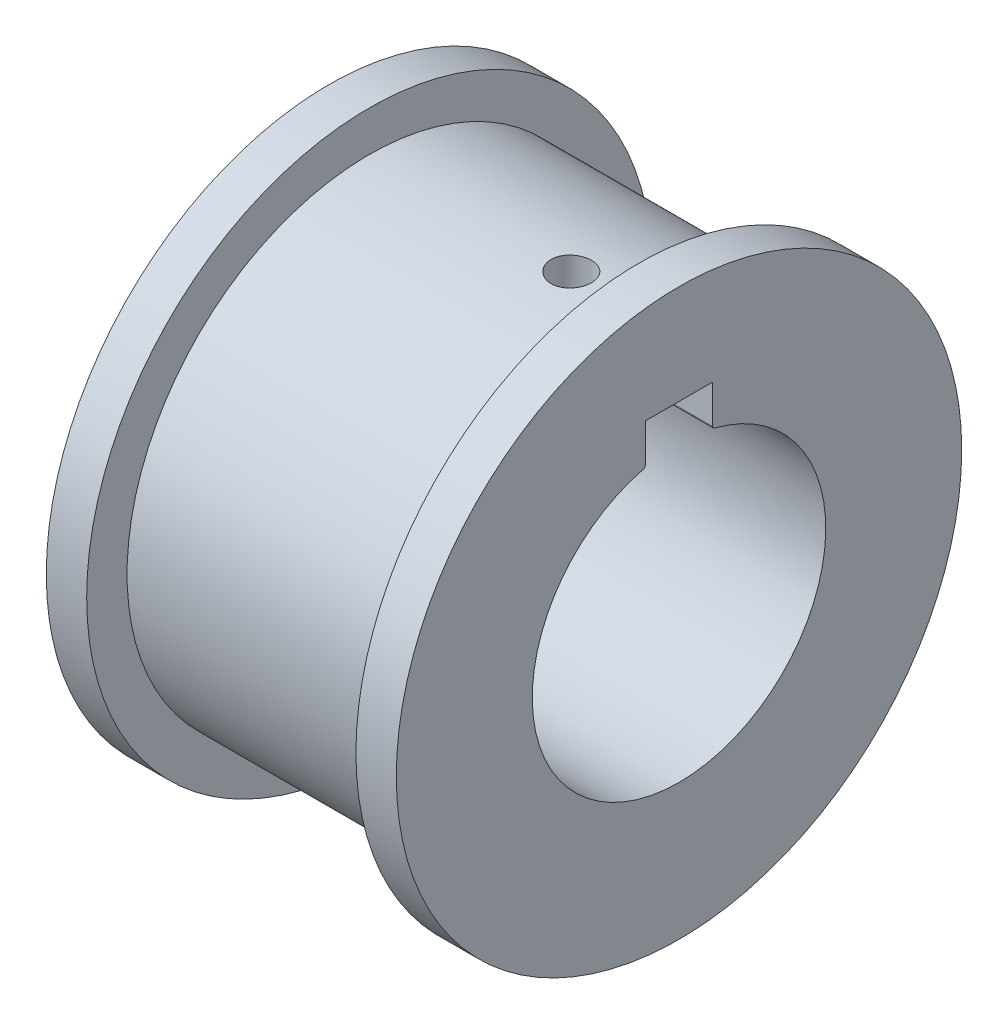
ISO-10303-21;
HEADER;
FILE_DESCRIPTION(('STEP AP214'),'2;1');
FILE_NAME('part.step','',(''),(''),'','','');
FILE_SCHEMA(('AUTOMOTIVE_DESIGN { 1 0 10303 214 1 1 1 1 }'));
ENDSEC;
DATA;
#1=APPLICATION_CONTEXT('core data for automotive mechanical design processes');
#2=APPLICATION_PROTOCOL_DEFINITION('international standard','automotive_design',2000,#1);
#3=PRODUCT_CONTEXT('',#1,'mechanical');
#4=PRODUCT('Part','Part','',(#3));
#5=PRODUCT_RELATED_PRODUCT_CATEGORY('part','',(#4));
#6=PRODUCT_DEFINITION_FORMATION('','',#4);
#7=PRODUCT_DEFINITION_CONTEXT('part definition',#1,'design');
#8=PRODUCT_DEFINITION('design','',#6,#7);
#9=PRODUCT_DEFINITION_SHAPE('','',#8);
#10=(LENGTH_UNIT() NAMED_UNIT(*) SI_UNIT(.MILLI.,.METRE.));
#11=(NAMED_UNIT(*) PLANE_ANGLE_UNIT() SI_UNIT($,.RADIAN.));
#12=(NAMED_UNIT(*) SI_UNIT($,.STERADIAN.) SOLID_ANGLE_UNIT());
#13=UNCERTAINTY_MEASURE_WITH_UNIT(LENGTH_MEASURE(1.E-05),#10,'distance_accuracy_value','');
#14=(GEOMETRIC_REPRESENTATION_CONTEXT(3) GLOBAL_UNCERTAINTY_ASSIGNED_CONTEXT((#13)) GLOBAL_UNIT_ASSIGNED_CONTEXT((#10,
#11,#12)) REPRESENTATION_CONTEXT('',''));
#15=CARTESIAN_POINT('',(0.,0.,0.));
#16=DIRECTION('',(0.,0.,1.));
#17=DIRECTION('',(1.,0.,0.));
#18=AXIS2_PLACEMENT_3D('',#15,#16,#17);
#19=CARTESIAN_POINT('',(23.,0.,0.));
#20=DIRECTION('',(1.,0.,0.));
#21=DIRECTION('',(0.,0.,-1.));
#22=AXIS2_PLACEMENT_3D('',#19,#20,#21);
#23=PLANE('',#22);
#24=CARTESIAN_POINT('',(23.,0.,0.));
#25=DIRECTION('',(1.,0.,0.));
#26=DIRECTION('',(0.,0.,-1.));
#27=AXIS2_PLACEMENT_3D('',#24,#25,#26);
#28=CIRCLE('',#27,21.);
#29=CARTESIAN_POINT('',(23.,0.,-21.));
#30=VERTEX_POINT('',#29);
#31=EDGE_CURVE('E131',#30,#30,#28,.T.);
#32=ORIENTED_EDGE('',*,*,#31,.T.);
#33=EDGE_LOOP('',(#32));
#34=FACE_BOUND('',#33,.T.);
#35=CARTESIAN_POINT('',(23.,0.,0.));
#36=DIRECTION('',(1.,0.,0.));
#37=DIRECTION('',(0.,0.,-1.));
#38=AXIS2_PLACEMENT_3D('',#35,#36,#37);
#39=CIRCLE('',#38,10.9);
#40=CARTESIAN_POINT('',(23.,10.5726220026863,2.65135135135135));
#41=VERTEX_POINT('',#40);
#42=CARTESIAN_POINT('',(23.,10.5726220026863,-2.65135135135136));
#43=VERTEX_POINT('',#42);
#44=EDGE_CURVE('E92',#41,#43,#39,.T.);
#45=ORIENTED_EDGE('',*,*,#44,.F.);
#46=CARTESIAN_POINT('',(23.,10.7666150669558,2.7));
#47=DIRECTION('',(-1.,0.,0.));
#48=DIRECTION('',(0.,0.,-1.));
#49=AXIS2_PLACEMENT_3D('',#46,#47,#48);
#50=CIRCLE('',#49,0.200000000000001);
#51=CARTESIAN_POINT('',(23.,10.7666150669558,2.5));
#52=VERTEX_POINT('',#51);
#53=EDGE_CURVE('E85',#52,#41,#50,.T.);
#54=ORIENTED_EDGE('',*,*,#53,.F.);
#55=DIRECTION('',(0.,-1.,0.));
#56=VECTOR('',#55,1.);
#57=CARTESIAN_POINT('',(23.,13.6094297678999,2.5));
#58=LINE('',#57,#56);
#59=CARTESIAN_POINT('',(23.,13.6094297678999,2.5));
#60=VERTEX_POINT('',#59);
#61=EDGE_CURVE('E114',#60,#52,#58,.T.);
#62=ORIENTED_EDGE('',*,*,#61,.F.);
#63=DIRECTION('',(0.,0.,1.));
#64=VECTOR('',#63,1.);
#65=CARTESIAN_POINT('',(23.,13.6094297678999,2.5));
#66=LINE('',#65,#64);
#67=CARTESIAN_POINT('',(23.,13.6094297678999,-2.5));
#68=VERTEX_POINT('',#67);
#69=EDGE_CURVE('E112',#68,#60,#66,.T.);
#70=ORIENTED_EDGE('',*,*,#69,.F.);
#71=DIRECTION('',(0.,1.,0.));
#72=VECTOR('',#71,1.);
#73=CARTESIAN_POINT('',(23.,13.6094297678999,-2.5));
#74=LINE('',#73,#72);
#75=CARTESIAN_POINT('',(23.,10.7666150669558,-2.5));
#76=VERTEX_POINT('',#75);
#77=EDGE_CURVE('E107',#76,#68,#74,.T.);
#78=ORIENTED_EDGE('',*,*,#77,.F.);
#79=CARTESIAN_POINT('',(23.,10.7666150669558,-2.7));
#80=DIRECTION('',(-1.,0.,0.));
#81=DIRECTION('',(0.,0.,1.));
#82=AXIS2_PLACEMENT_3D('',#79,#80,#81);
#83=CIRCLE('',#82,0.2);
#84=EDGE_CURVE('E105',#43,#76,#83,.T.);
#85=ORIENTED_EDGE('',*,*,#84,.F.);
#86=EDGE_LOOP('',(#45,#54,#62,#70,#78,#85));
#87=FACE_BOUND('',#86,.T.);
#88=ADVANCED_FACE('F32',(#34,#87),#23,.T.);
#89=CARTESIAN_POINT('',(-3.,0.,0.));
#90=DIRECTION('',(-1.,0.,0.));
#91=DIRECTION('',(0.,0.,1.));
#92=AXIS2_PLACEMENT_3D('',#89,#90,#91);
#93=PLANE('',#92);
#94=CARTESIAN_POINT('',(-3.,0.,0.));
#95=DIRECTION('',(-1.,0.,0.));
#96=DIRECTION('',(0.,0.,1.));
#97=AXIS2_PLACEMENT_3D('',#94,#95,#96);
#98=CIRCLE('',#97,21.);
#99=CARTESIAN_POINT('',(-3.,0.,21.));
#100=VERTEX_POINT('',#99);
#101=EDGE_CURVE('E125',#100,#100,#98,.T.);
#102=ORIENTED_EDGE('',*,*,#101,.T.);
#103=EDGE_LOOP('',(#102));
#104=FACE_BOUND('',#103,.T.);
#105=DIRECTION('',(0.,-1.,0.));
#106=VECTOR('',#105,1.);
#107=CARTESIAN_POINT('',(-3.,0.,2.5));
#108=LINE('',#107,#106);
#109=CARTESIAN_POINT('',(-3.,13.6094297678999,2.5));
#110=VERTEX_POINT('',#109);
#111=CARTESIAN_POINT('',(-3.,10.7666150669558,2.5));
#112=VERTEX_POINT('',#111);
#113=EDGE_CURVE('E140',#110,#112,#108,.T.);
#114=ORIENTED_EDGE('',*,*,#113,.T.);
#115=CARTESIAN_POINT('',(-3.,10.7666150669558,2.7));
#116=DIRECTION('',(-1.,0.,0.));
#117=DIRECTION('',(0.,0.,1.));
#118=AXIS2_PLACEMENT_3D('',#115,#116,#117);
#119=CIRCLE('',#118,0.200000000000001);
#120=CARTESIAN_POINT('',(-3.,10.5726220026863,2.65135135135135));
#121=VERTEX_POINT('',#120);
#122=EDGE_CURVE('E11',#112,#121,#119,.T.);
#123=ORIENTED_EDGE('',*,*,#122,.T.);
#124=CARTESIAN_POINT('',(-3.,0.,0.));
#125=DIRECTION('',(-1.,0.,0.));
#126=DIRECTION('',(0.,0.,1.));
#127=AXIS2_PLACEMENT_3D('',#124,#125,#126);
#128=CIRCLE('',#127,10.9);
#129=CARTESIAN_POINT('',(-3.,10.5726220026863,-2.65135135135136));
#130=VERTEX_POINT('',#129);
#131=EDGE_CURVE('E41',#121,#130,#128,.F.);
#132=ORIENTED_EDGE('',*,*,#131,.T.);
#133=CARTESIAN_POINT('',(-3.,10.7666150669558,-2.7));
#134=DIRECTION('',(-1.,0.,0.));
#135=DIRECTION('',(0.,0.,1.));
#136=AXIS2_PLACEMENT_3D('',#133,#134,#135);
#137=CIRCLE('',#136,0.2);
#138=CARTESIAN_POINT('',(-3.,10.7666150669558,-2.5));
#139=VERTEX_POINT('',#138);
#140=EDGE_CURVE('E151',#130,#139,#137,.T.);
#141=ORIENTED_EDGE('',*,*,#140,.T.);
#142=DIRECTION('',(0.,1.,0.));
#143=VECTOR('',#142,1.);
#144=CARTESIAN_POINT('',(-3.,0.,-2.50000000000001));
#145=LINE('',#144,#143);
#146=CARTESIAN_POINT('',(-3.,13.6094297678999,-2.5));
#147=VERTEX_POINT('',#146);
#148=EDGE_CURVE('E148',#139,#147,#145,.T.);
#149=ORIENTED_EDGE('',*,*,#148,.T.);
#150=DIRECTION('',(0.,0.,1.));
#151=VECTOR('',#150,1.);
#152=CARTESIAN_POINT('',(-3.,13.6094297678999,0.));
#153=LINE('',#152,#151);
#154=EDGE_CURVE('E145',#147,#110,#153,.T.);
#155=ORIENTED_EDGE('',*,*,#154,.T.);
#156=EDGE_LOOP('',(#114,#123,#132,#141,#149,#155));
#157=FACE_BOUND('',#156,.T.);
#158=ADVANCED_FACE('F154',(#104,#157),#93,.T.);
#159=CARTESIAN_POINT('',(20.,0.,0.));
#160=DIRECTION('',(-1.,0.,0.));
#161=DIRECTION('',(0.,0.,1.));
#162=AXIS2_PLACEMENT_3D('',#159,#160,#161);
#163=CYLINDRICAL_SURFACE('',#162,18.);
#164=CARTESIAN_POINT('',(15.,17.9373911146521,-1.5));
#165=CARTESIAN_POINT('',(15.0840985631856,17.9373919441254,-1.49999632624557));
#166=CARTESIAN_POINT('',(15.1682543792365,17.9379889197393,-1.49290363793974));
#167=CARTESIAN_POINT('',(15.3342375305151,17.940312296239,-1.46471396861144));
#168=CARTESIAN_POINT('',(15.4160621176914,17.942039976827,-1.44360111954249));
#169=CARTESIAN_POINT('',(15.574954794188,17.9464277324401,-1.38798597710629));
#170=CARTESIAN_POINT('',(15.6520255514324,17.949087278784,-1.35349127456329));
#171=CARTESIAN_POINT('',(15.7992647928149,17.9550384405243,-1.27210510272819));
#172=CARTESIAN_POINT('',(15.8694347481826,17.9583299207505,-1.22521628371904));
#173=CARTESIAN_POINT('',(16.0010790046,17.9651835716923,-1.12024280468706));
#174=CARTESIAN_POINT('',(16.0625331477945,17.9687463415354,-1.06213290210282));
#175=CARTESIAN_POINT('',(16.174828149357,17.9757356491616,-0.936420181014144));
#176=CARTESIAN_POINT('',(16.2256685440314,17.9791621809873,-0.86881694798052));
#177=CARTESIAN_POINT('',(16.3153599219843,17.9854986076127,-0.725916367963188));
#178=CARTESIAN_POINT('',(16.3541934647722,17.9884077482992,-0.650608038188791));
#179=CARTESIAN_POINT('',(16.4186572366777,17.9933751565843,-0.494511600748147));
#180=CARTESIAN_POINT('',(16.4442876968973,17.995433439076,-0.413723589024245));
#181=CARTESIAN_POINT('',(16.4815597257841,17.99846303179,-0.249161693921719));
#182=CARTESIAN_POINT('',(16.4932339066792,17.9994368756993,-0.165395244348485));
#183=CARTESIAN_POINT('',(16.5023628047769,18.0001964510134,0.00291342283472642));
#184=CARTESIAN_POINT('',(16.4998177864049,17.9999822045124,0.0874556259893205));
#185=CARTESIAN_POINT('',(16.4806072017309,17.9983918295819,0.25469482727822));
#186=CARTESIAN_POINT('',(16.4639767052937,17.9970185868379,0.337395885108696));
#187=CARTESIAN_POINT('',(16.4171217735569,17.9932679978193,0.498828699060365));
#188=CARTESIAN_POINT('',(16.3868972089162,17.9908906419909,0.577560417407251));
#189=CARTESIAN_POINT('',(16.3136730193221,17.9853943186844,0.728931240955282));
#190=CARTESIAN_POINT('',(16.2706576881019,17.9822744403804,0.801562713988459));
#191=CARTESIAN_POINT('',(16.1730844176321,17.9756436790388,0.938588003816052));
#192=CARTESIAN_POINT('',(16.1185262442516,17.9721327880706,1.0029816534748));
#193=CARTESIAN_POINT('',(15.9992183400671,17.965101971209,1.12190844717284));
#194=CARTESIAN_POINT('',(15.9344381357718,17.96158205029,1.17641102499754));
#195=CARTESIAN_POINT('',(15.7966312423255,17.9549406265857,1.27377239838405));
#196=CARTESIAN_POINT('',(15.7236045463767,17.9518191241289,1.31663118434747));
#197=CARTESIAN_POINT('',(15.5713561683423,17.9463273914548,1.38948720688987));
#198=CARTESIAN_POINT('',(15.4921337235797,17.9439572539101,1.41948285710205));
#199=CARTESIAN_POINT('',(15.3297529229235,17.9402383991997,1.46573851054276));
#200=CARTESIAN_POINT('',(15.2465946498153,17.9388896605602,1.4819988025422));
#201=CARTESIAN_POINT('',(15.0789702201671,17.937369793448,1.50028347436892));
#202=CARTESIAN_POINT('',(14.9945087438297,17.9371951390236,1.50235047917683));
#203=CARTESIAN_POINT('',(14.8264404845256,17.9380339082073,1.49230155756723));
#204=CARTESIAN_POINT('',(14.7428336935942,17.9390473207338,1.48018576343823));
#205=CARTESIAN_POINT('',(14.5789704663007,17.9421448221712,1.44215070186372));
#206=CARTESIAN_POINT('',(14.4987093810554,17.9442273679871,1.41625132648417));
#207=CARTESIAN_POINT('',(14.3436718767544,17.9492272046942,1.35140451334476));
#208=CARTESIAN_POINT('',(14.2688955457271,17.9521445089794,1.3124568662206));
#209=CARTESIAN_POINT('',(14.1267551216711,17.9584937019478,1.22251123196842));
#210=CARTESIAN_POINT('',(14.0594090574024,17.9619267965011,1.17148484052755));
#211=CARTESIAN_POINT('',(13.9342230886397,17.9689166666067,1.05887119262326));
#212=CARTESIAN_POINT('',(13.8763833477565,17.9724734442863,0.997283754433896));
#213=CARTESIAN_POINT('',(13.7717063913449,17.9793204166324,0.86511205936761));
#214=CARTESIAN_POINT('',(13.7248968704953,17.9826099269711,0.79450582861474));
#215=CARTESIAN_POINT('',(13.6437991296532,17.9885418580659,0.646410289821602));
#216=CARTESIAN_POINT('',(13.6095107845369,17.9911842852881,0.56892105057266));
#217=CARTESIAN_POINT('',(13.5544762763759,17.9955211682902,0.409358368150552));
#218=CARTESIAN_POINT('',(13.5337129872812,17.9972168225275,0.327290865780904));
#219=CARTESIAN_POINT('',(13.5062620113689,17.9994739699475,0.160819768599443));
#220=CARTESIAN_POINT('',(13.4995740581226,18.0000354845981,0.076416218036738));
#221=CARTESIAN_POINT('',(13.5004667094015,17.9999611181007,-0.0920580725938577));
#222=CARTESIAN_POINT('',(13.5080041527578,17.9993288589703,-0.176129046317084));
#223=CARTESIAN_POINT('',(13.5370436317673,17.9969451509331,-0.341806668092005));
#224=CARTESIAN_POINT('',(13.5585456863876,17.9951937005063,-0.423413312796426));
#225=CARTESIAN_POINT('',(13.6148930551836,17.990768125559,-0.581848569673132));
#226=CARTESIAN_POINT('',(13.6497375940244,17.9880940546532,-0.658677459180395));
#227=CARTESIAN_POINT('',(13.7317758680965,17.9821223994119,-0.805401859348538));
#228=CARTESIAN_POINT('',(13.7789694080388,17.9788248249368,-0.875297479629091));
#229=CARTESIAN_POINT('',(13.8845280222736,17.9719643775245,-1.00639213413819));
#230=CARTESIAN_POINT('',(13.9429250330198,17.9684007644022,-1.06756541397693));
#231=CARTESIAN_POINT('',(14.0691752530889,17.9614161747032,-1.17926673983932));
#232=CARTESIAN_POINT('',(14.1370307491243,17.9579952328797,-1.22979220417235));
#233=CARTESIAN_POINT('',(14.2804035010514,17.9516763661302,-1.31883206846829));
#234=CARTESIAN_POINT('',(14.3559348750019,17.9487794332231,-1.3573237851877));
#235=CARTESIAN_POINT('',(14.5123611551019,17.9438486940789,-1.4210293514007));
#236=CARTESIAN_POINT('',(14.5932497736258,17.9418138960345,-1.4462584663942));
#237=CARTESIAN_POINT('',(14.7288463263408,17.939361122821,-1.47629714700913));
#238=CARTESIAN_POINT('',(14.7826821791678,17.9386257658358,-1.48517390108766));
#239=CARTESIAN_POINT('',(14.8910040047623,17.9376404935845,-1.49702651025999));
#240=CARTESIAN_POINT('',(14.9454899757822,17.9373905770138,-1.50000238121123));
#241=CARTESIAN_POINT('',(15.,17.9373911146521,-1.5));
#242=B_SPLINE_CURVE_WITH_KNOTS('',3,(#164,#165,#166,#167,#168,#169,#170,#171,#172,#173,#174,
#175,#176,#177,#178,#179,#180,#181,#182,#183,#184,#185,#186,#187,#188,#189,#190,#191,#192,#193,
#194,#195,#196,#197,#198,#199,#200,#201,#202,#203,#204,#205,#206,#207,#208,#209,#210,#211,#212,
#213,#214,#215,#216,#217,#218,#219,#220,#221,#222,#223,#224,#225,#226,#227,#228,#229,#230,#231,
#232,#233,#234,#235,#236,#237,#238,#239,#240,#241),.UNSPECIFIED.,.T.,.F.,(4,2,2,2,2,2,2,2,2,2,2,
2,2,2,2,2,2,2,2,2,2,2,2,2,2,2,2,2,2,2,2,2,2,2,2,2,2,2,4),(0.,0.252096663075892,0.50447913707576,
0.756718656565788,1.00890428225374,1.26166396783762,1.51443469368451,1.76757087390708,
2.02070262317667,2.27324170533034,2.52577609119157,2.77768356187025,3.02959342937963,
3.28181391301508,3.53403951309371,3.78703176034209,4.0400242161406,4.29304786367221,
4.54606619152565,4.79832432644861,5.05058010848022,5.3024728255471,5.55436958451818,
5.80686469264508,6.05936414593926,6.31249097605477,6.56561527661194,6.81841843321506,
7.07121680452791,7.32324939506092,7.575282327912,7.82730061729244,8.07931492145807,
8.33205858485541,8.58486345866072,8.83814202808076,9.09112842731077,9.254529936414,
9.41793100640811),.UNSPECIFIED.);
#243=CARTESIAN_POINT('',(15.,17.9373911146521,-1.5));
#244=VERTEX_POINT('',#243);
#245=EDGE_CURVE('E93',#244,#244,#242,.T.);
#246=ORIENTED_EDGE('',*,*,#245,.T.);
#247=EDGE_LOOP('',(#246));
#248=FACE_BOUND('',#247,.T.);
#249=CARTESIAN_POINT('',(20.,0.,0.));
#250=DIRECTION('',(1.,0.,0.));
#251=DIRECTION('',(0.,0.,-1.));
#252=AXIS2_PLACEMENT_3D('',#249,#250,#251);
#253=CIRCLE('',#252,18.);
#254=CARTESIAN_POINT('',(20.,0.,-18.));
#255=VERTEX_POINT('',#254);
#256=EDGE_CURVE('E134',#255,#255,#253,.T.);
#257=ORIENTED_EDGE('',*,*,#256,.F.);
#258=EDGE_LOOP('',(#257));
#259=FACE_BOUND('',#258,.T.);
#260=CARTESIAN_POINT('',(0.,0.,0.));
#261=DIRECTION('',(1.,0.,0.));
#262=DIRECTION('',(0.,0.,-1.));
#263=AXIS2_PLACEMENT_3D('',#260,#261,#262);
#264=CIRCLE('',#263,18.);
#265=CARTESIAN_POINT('',(0.,0.,-18.));
#266=VERTEX_POINT('',#265);
#267=EDGE_CURVE('E128',#266,#266,#264,.T.);
#268=ORIENTED_EDGE('',*,*,#267,.T.);
#269=EDGE_LOOP('',(#268));
#270=FACE_BOUND('',#269,.T.);
#271=ADVANCED_FACE('F34',(#248,#259,#270),#163,.T.);
#272=CARTESIAN_POINT('',(23.,0.,0.));
#273=DIRECTION('',(-1.,0.,0.));
#274=DIRECTION('',(0.,0.,1.));
#275=AXIS2_PLACEMENT_3D('',#272,#273,#274);
#276=CYLINDRICAL_SURFACE('',#275,21.);
#277=ORIENTED_EDGE('',*,*,#31,.F.);
#278=EDGE_LOOP('',(#277));
#279=FACE_BOUND('',#278,.T.);
#280=CARTESIAN_POINT('',(20.,0.,0.));
#281=DIRECTION('',(1.,0.,0.));
#282=DIRECTION('',(0.,0.,-1.));
#283=AXIS2_PLACEMENT_3D('',#280,#281,#282);
#284=CIRCLE('',#283,21.);
#285=CARTESIAN_POINT('',(20.,0.,-21.));
#286=VERTEX_POINT('',#285);
#287=EDGE_CURVE('E135',#286,#286,#284,.T.);
#288=ORIENTED_EDGE('',*,*,#287,.T.);
#289=EDGE_LOOP('',(#288));
#290=FACE_BOUND('',#289,.T.);
#291=ADVANCED_FACE('F187',(#279,#290),#276,.T.);
#292=CARTESIAN_POINT('',(20.,0.,0.));
#293=DIRECTION('',(1.,0.,0.));
#294=DIRECTION('',(0.,0.,-1.));
#295=AXIS2_PLACEMENT_3D('',#292,#293,#294);
#296=PLANE('',#295);
#297=ORIENTED_EDGE('',*,*,#256,.T.);
#298=EDGE_LOOP('',(#297));
#299=FACE_BOUND('',#298,.T.);
#300=ORIENTED_EDGE('',*,*,#287,.F.);
#301=EDGE_LOOP('',(#300));
#302=FACE_BOUND('',#301,.T.);
#303=ADVANCED_FACE('F185',(#299,#302),#296,.F.);
#304=CARTESIAN_POINT('',(-3.,0.,0.));
#305=DIRECTION('',(1.,0.,0.));
#306=DIRECTION('',(0.,0.,-1.));
#307=AXIS2_PLACEMENT_3D('',#304,#305,#306);
#308=CYLINDRICAL_SURFACE('',#307,21.);
#309=ORIENTED_EDGE('',*,*,#101,.F.);
#310=EDGE_LOOP('',(#309));
#311=FACE_BOUND('',#310,.T.);
#312=CARTESIAN_POINT('',(0.,0.,0.));
#313=DIRECTION('',(-1.,0.,0.));
#314=DIRECTION('',(0.,0.,1.));
#315=AXIS2_PLACEMENT_3D('',#312,#313,#314);
#316=CIRCLE('',#315,21.);
#317=CARTESIAN_POINT('',(0.,0.,21.));
#318=VERTEX_POINT('',#317);
#319=EDGE_CURVE('E100',#318,#318,#316,.T.);
#320=ORIENTED_EDGE('',*,*,#319,.T.);
#321=EDGE_LOOP('',(#320));
#322=FACE_BOUND('',#321,.T.);
#323=ADVANCED_FACE('F183',(#311,#322),#308,.T.);
#324=CARTESIAN_POINT('',(0.,0.,0.));
#325=DIRECTION('',(-1.,0.,0.));
#326=DIRECTION('',(0.,0.,1.));
#327=AXIS2_PLACEMENT_3D('',#324,#325,#326);
#328=PLANE('',#327);
#329=ORIENTED_EDGE('',*,*,#267,.F.);
#330=EDGE_LOOP('',(#329));
#331=FACE_BOUND('',#330,.T.);
#332=ORIENTED_EDGE('',*,*,#319,.F.);
#333=EDGE_LOOP('',(#332));
#334=FACE_BOUND('',#333,.T.);
#335=ADVANCED_FACE('F208',(#331,#334),#328,.F.);
#336=CARTESIAN_POINT('',(23.,10.7666150669558,2.7));
#337=DIRECTION('',(-1.,0.,0.));
#338=DIRECTION('',(0.,0.,1.));
#339=AXIS2_PLACEMENT_3D('',#336,#337,#338);
#340=CYLINDRICAL_SURFACE('',#339,0.200000000000001);
#341=DIRECTION('',(-1.,0.,0.));
#342=VECTOR('',#341,1.);
#343=CARTESIAN_POINT('',(23.,10.7666150669558,2.5));
#344=LINE('',#343,#342);
#345=EDGE_CURVE('E53',#52,#112,#344,.T.);
#346=ORIENTED_EDGE('',*,*,#345,.F.);
#347=ORIENTED_EDGE('',*,*,#53,.T.);
#348=DIRECTION('',(-1.,0.,0.));
#349=VECTOR('',#348,1.);
#350=CARTESIAN_POINT('',(23.,10.5726220026863,2.65135135135135));
#351=LINE('',#350,#349);
#352=EDGE_CURVE('E88',#41,#121,#351,.T.);
#353=ORIENTED_EDGE('',*,*,#352,.T.);
#354=ORIENTED_EDGE('',*,*,#122,.F.);
#355=EDGE_LOOP('',(#346,#347,#353,#354));
#356=FACE_BOUND('',#355,.T.);
#357=ADVANCED_FACE('F87',(#356),#340,.T.);
#358=CARTESIAN_POINT('',(23.,0.,0.));
#359=DIRECTION('',(-1.,0.,0.));
#360=DIRECTION('',(0.,0.,1.));
#361=AXIS2_PLACEMENT_3D('',#358,#359,#360);
#362=CYLINDRICAL_SURFACE('',#361,10.9);
#363=ORIENTED_EDGE('',*,*,#352,.F.);
#364=ORIENTED_EDGE('',*,*,#44,.T.);
#365=DIRECTION('',(-1.,0.,0.));
#366=VECTOR('',#365,1.);
#367=CARTESIAN_POINT('',(23.,10.5726220026863,-2.65135135135136));
#368=LINE('',#367,#366);
#369=EDGE_CURVE('E101',#43,#130,#368,.T.);
#370=ORIENTED_EDGE('',*,*,#369,.T.);
#371=ORIENTED_EDGE('',*,*,#131,.F.);
#372=EDGE_LOOP('',(#363,#364,#370,#371));
#373=FACE_BOUND('',#372,.T.);
#374=ADVANCED_FACE('F96',(#373),#362,.F.);
#375=CARTESIAN_POINT('',(23.,10.7666150669558,-2.7));
#376=DIRECTION('',(-1.,0.,0.));
#377=DIRECTION('',(0.,0.,1.));
#378=AXIS2_PLACEMENT_3D('',#375,#376,#377);
#379=CYLINDRICAL_SURFACE('',#378,0.2);
#380=ORIENTED_EDGE('',*,*,#369,.F.);
#381=ORIENTED_EDGE('',*,*,#84,.T.);
#382=DIRECTION('',(-1.,0.,0.));
#383=VECTOR('',#382,1.);
#384=CARTESIAN_POINT('',(23.,10.7666150669558,-2.5));
#385=LINE('',#384,#383);
#386=EDGE_CURVE('E121',#76,#139,#385,.T.);
#387=ORIENTED_EDGE('',*,*,#386,.T.);
#388=ORIENTED_EDGE('',*,*,#140,.F.);
#389=EDGE_LOOP('',(#380,#381,#387,#388));
#390=FACE_BOUND('',#389,.T.);
#391=ADVANCED_FACE('F164',(#390),#379,.T.);
#392=CARTESIAN_POINT('',(23.,13.6094297678999,-2.5));
#393=DIRECTION('',(0.,0.,1.));
#394=DIRECTION('',(0.,-1.,0.));
#395=AXIS2_PLACEMENT_3D('',#392,#393,#394);
#396=PLANE('',#395);
#397=ORIENTED_EDGE('',*,*,#386,.F.);
#398=ORIENTED_EDGE('',*,*,#77,.T.);
#399=DIRECTION('',(-1.,0.,0.));
#400=VECTOR('',#399,1.);
#401=CARTESIAN_POINT('',(23.,13.6094297678999,-2.5));
#402=LINE('',#401,#400);
#403=EDGE_CURVE('E118',#68,#147,#402,.T.);
#404=ORIENTED_EDGE('',*,*,#403,.T.);
#405=ORIENTED_EDGE('',*,*,#148,.F.);
#406=EDGE_LOOP('',(#397,#398,#404,#405));
#407=FACE_BOUND('',#406,.T.);
#408=ADVANCED_FACE('F162',(#407),#396,.T.);
#409=CARTESIAN_POINT('',(23.,13.6094297678999,2.5));
#410=DIRECTION('',(0.,-1.,0.));
#411=DIRECTION('',(0.,0.,-1.));
#412=AXIS2_PLACEMENT_3D('',#409,#410,#411);
#413=PLANE('',#412);
#414=CARTESIAN_POINT('',(15.,13.6094297678999,0.));
#415=DIRECTION('',(0.,-1.,0.));
#416=DIRECTION('',(0.,0.,-1.));
#417=AXIS2_PLACEMENT_3D('',#414,#415,#416);
#418=CIRCLE('',#417,1.5);
#419=CARTESIAN_POINT('',(15.,13.6094297678999,-1.50000000000001));
#420=VERTEX_POINT('',#419);
#421=EDGE_CURVE('E288',#420,#420,#418,.T.);
#422=ORIENTED_EDGE('',*,*,#421,.F.);
#423=EDGE_LOOP('',(#422));
#424=FACE_BOUND('',#423,.T.);
#425=ORIENTED_EDGE('',*,*,#403,.F.);
#426=ORIENTED_EDGE('',*,*,#69,.T.);
#427=DIRECTION('',(-1.,0.,0.));
#428=VECTOR('',#427,1.);
#429=CARTESIAN_POINT('',(23.,13.6094297678999,2.5));
#430=LINE('',#429,#428);
#431=EDGE_CURVE('E48',#60,#110,#430,.T.);
#432=ORIENTED_EDGE('',*,*,#431,.T.);
#433=ORIENTED_EDGE('',*,*,#154,.F.);
#434=EDGE_LOOP('',(#425,#426,#432,#433));
#435=FACE_BOUND('',#434,.T.);
#436=ADVANCED_FACE('F158',(#424,#435),#413,.T.);
#437=CARTESIAN_POINT('',(23.,13.6094297678999,2.5));
#438=DIRECTION('',(0.,0.,-1.));
#439=DIRECTION('',(-1.,0.,0.));
#440=AXIS2_PLACEMENT_3D('',#437,#438,#439);
#441=PLANE('',#440);
#442=ORIENTED_EDGE('',*,*,#431,.F.);
#443=ORIENTED_EDGE('',*,*,#61,.T.);
#444=ORIENTED_EDGE('',*,*,#345,.T.);
#445=ORIENTED_EDGE('',*,*,#113,.F.);
#446=EDGE_LOOP('',(#442,#443,#444,#445));
#447=FACE_BOUND('',#446,.T.);
#448=ADVANCED_FACE('F155',(#447),#441,.T.);
#449=CARTESIAN_POINT('',(15.,33.6094297678999,0.));
#450=DIRECTION('',(0.,-1.,0.));
#451=DIRECTION('',(0.,0.,-1.));
#452=AXIS2_PLACEMENT_3D('',#449,#450,#451);
#453=CYLINDRICAL_SURFACE('',#452,1.5);
#454=ORIENTED_EDGE('',*,*,#421,.T.);
#455=EDGE_LOOP('',(#454));
#456=FACE_BOUND('',#455,.T.);
#457=ORIENTED_EDGE('',*,*,#245,.F.);
#458=EDGE_LOOP('',(#457));
#459=FACE_BOUND('',#458,.T.);
#460=ADVANCED_FACE('F255',(#456,#459),#453,.F.);
#461=CLOSED_SHELL('',(#88,#158,#271,#291,#303,#323,#335,#357,#374,#391,#408,#436,#448,#460));
#462=MANIFOLD_SOLID_BREP('B2',#461);
#463=ADVANCED_BREP_SHAPE_REPRESENTATION('',(#18,#462),#14);
#464=SHAPE_DEFINITION_REPRESENTATION(#9,#463);
ENDSEC;
END-ISO-10303-21;
